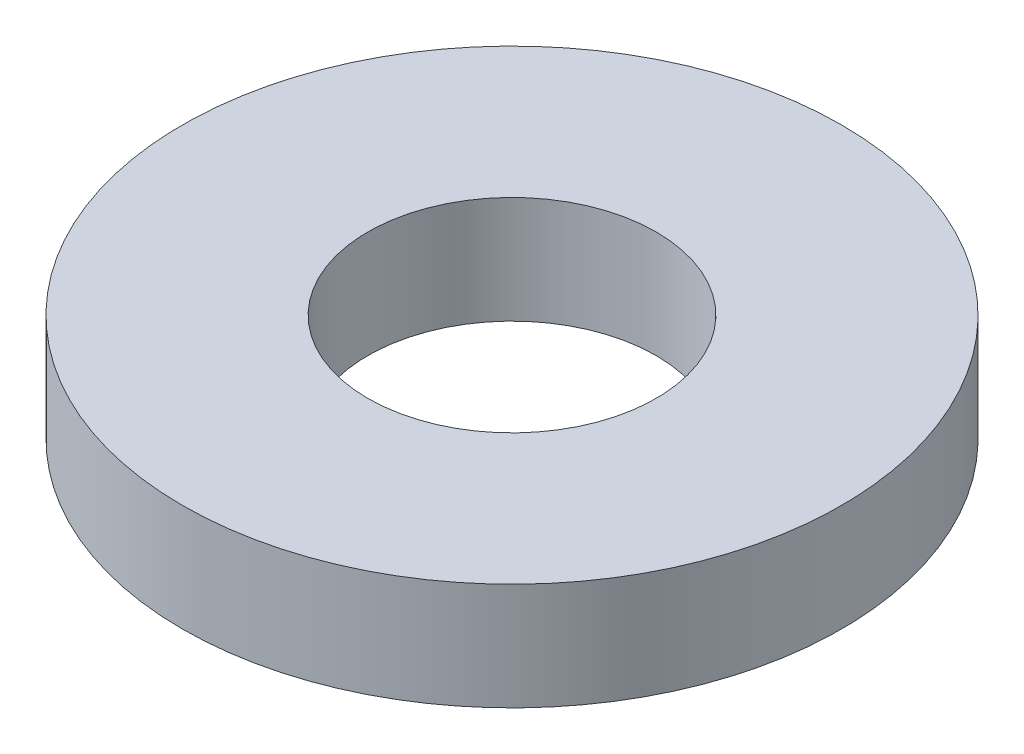
ISO-10303-21;
HEADER;
FILE_DESCRIPTION(('STEP AP214'),'2;1');
FILE_NAME('part.step','',(''),(''),'','','');
FILE_SCHEMA(('AUTOMOTIVE_DESIGN { 1 0 10303 214 1 1 1 1 }'));
ENDSEC;
DATA;
#1=APPLICATION_CONTEXT('core data for automotive mechanical design processes');
#2=APPLICATION_PROTOCOL_DEFINITION('international standard','automotive_design',2000,#1);
#3=PRODUCT_CONTEXT('',#1,'mechanical');
#4=PRODUCT('Part','Part','',(#3));
#5=PRODUCT_RELATED_PRODUCT_CATEGORY('part','',(#4));
#6=PRODUCT_DEFINITION_FORMATION('','',#4);
#7=PRODUCT_DEFINITION_CONTEXT('part definition',#1,'design');
#8=PRODUCT_DEFINITION('design','',#6,#7);
#9=PRODUCT_DEFINITION_SHAPE('','',#8);
#10=(LENGTH_UNIT() NAMED_UNIT(*) SI_UNIT(.MILLI.,.METRE.));
#11=(NAMED_UNIT(*) PLANE_ANGLE_UNIT() SI_UNIT($,.RADIAN.));
#12=(NAMED_UNIT(*) SI_UNIT($,.STERADIAN.) SOLID_ANGLE_UNIT());
#13=UNCERTAINTY_MEASURE_WITH_UNIT(LENGTH_MEASURE(1.E-05),#10,'distance_accuracy_value','');
#14=(GEOMETRIC_REPRESENTATION_CONTEXT(3) GLOBAL_UNCERTAINTY_ASSIGNED_CONTEXT((#13)) GLOBAL_UNIT_ASSIGNED_CONTEXT((#10,
#11,#12)) REPRESENTATION_CONTEXT('',''));
#15=CARTESIAN_POINT('',(0.,0.,0.));
#16=DIRECTION('',(0.,0.,1.));
#17=DIRECTION('',(1.,0.,0.));
#18=AXIS2_PLACEMENT_3D('',#15,#16,#17);
#19=CARTESIAN_POINT('',(0.,13.,0.));
#20=DIRECTION('',(0.,-1.,0.));
#21=DIRECTION('',(0.,0.,-1.));
#22=AXIS2_PLACEMENT_3D('',#19,#20,#21);
#23=CYLINDRICAL_SURFACE('',#22,40.);
#24=CARTESIAN_POINT('',(0.,13.,0.));
#25=DIRECTION('',(0.,1.,0.));
#26=DIRECTION('',(0.,0.,1.));
#27=AXIS2_PLACEMENT_3D('',#24,#25,#26);
#28=CIRCLE('',#27,40.);
#29=CARTESIAN_POINT('',(0.,13.,-40.));
#30=VERTEX_POINT('',#29);
#31=EDGE_CURVE('E10',#30,#30,#28,.T.);
#32=CARTESIAN_POINT('',(0.,0.,0.));
#33=DIRECTION('',(0.,1.,0.));
#34=DIRECTION('',(0.,0.,1.));
#35=AXIS2_PLACEMENT_3D('',#32,#33,#34);
#36=CIRCLE('',#35,40.);
#37=CARTESIAN_POINT('',(0.,0.,-40.));
#38=VERTEX_POINT('',#37);
#39=EDGE_CURVE('E37',#38,#38,#36,.T.);
#40=CARTESIAN_POINT('',(0.,13.,-40.));
#41=CARTESIAN_POINT('',(0.,12.8645833333333,-40.));
#42=CARTESIAN_POINT('',(0.,12.7291666666667,-40.));
#43=CARTESIAN_POINT('',(0.,12.4583333333333,-40.));
#44=CARTESIAN_POINT('',(0.,12.3229166666667,-40.));
#45=CARTESIAN_POINT('',(0.,12.0520833333333,-40.));
#46=CARTESIAN_POINT('',(0.,11.9166666666667,-40.));
#47=CARTESIAN_POINT('',(0.,11.6458333333333,-40.));
#48=CARTESIAN_POINT('',(0.,11.5104166666667,-40.));
#49=CARTESIAN_POINT('',(0.,11.2395833333333,-40.));
#50=CARTESIAN_POINT('',(0.,11.1041666666667,-40.));
#51=CARTESIAN_POINT('',(0.,10.8333333333333,-40.));
#52=CARTESIAN_POINT('',(0.,10.6979166666667,-40.));
#53=CARTESIAN_POINT('',(0.,10.4270833333333,-40.));
#54=CARTESIAN_POINT('',(0.,10.2916666666667,-40.));
#55=CARTESIAN_POINT('',(0.,10.0208333333333,-40.));
#56=CARTESIAN_POINT('',(0.,9.88541666666667,-40.));
#57=CARTESIAN_POINT('',(0.,9.61458333333333,-40.));
#58=CARTESIAN_POINT('',(0.,9.47916666666667,-40.));
#59=CARTESIAN_POINT('',(0.,9.20833333333333,-40.));
#60=CARTESIAN_POINT('',(0.,9.07291666666667,-40.));
#61=CARTESIAN_POINT('',(0.,8.80208333333333,-40.));
#62=CARTESIAN_POINT('',(0.,8.66666666666667,-40.));
#63=CARTESIAN_POINT('',(0.,8.39583333333333,-40.));
#64=CARTESIAN_POINT('',(0.,8.26041666666667,-40.));
#65=CARTESIAN_POINT('',(0.,7.98958333333333,-40.));
#66=CARTESIAN_POINT('',(0.,7.85416666666667,-40.));
#67=CARTESIAN_POINT('',(0.,7.58333333333333,-40.));
#68=CARTESIAN_POINT('',(0.,7.44791666666667,-40.));
#69=CARTESIAN_POINT('',(0.,7.17708333333333,-40.));
#70=CARTESIAN_POINT('',(0.,7.04166666666667,-40.));
#71=CARTESIAN_POINT('',(0.,6.77083333333333,-40.));
#72=CARTESIAN_POINT('',(0.,6.63541666666667,-40.));
#73=CARTESIAN_POINT('',(0.,6.36458333333333,-40.));
#74=CARTESIAN_POINT('',(0.,6.22916666666667,-40.));
#75=CARTESIAN_POINT('',(0.,5.95833333333333,-40.));
#76=CARTESIAN_POINT('',(0.,5.82291666666667,-40.));
#77=CARTESIAN_POINT('',(0.,5.55208333333333,-40.));
#78=CARTESIAN_POINT('',(0.,5.41666666666667,-40.));
#79=CARTESIAN_POINT('',(0.,5.14583333333333,-40.));
#80=CARTESIAN_POINT('',(0.,5.01041666666667,-40.));
#81=CARTESIAN_POINT('',(0.,4.73958333333333,-40.));
#82=CARTESIAN_POINT('',(0.,4.60416666666667,-40.));
#83=CARTESIAN_POINT('',(0.,4.33333333333333,-40.));
#84=CARTESIAN_POINT('',(0.,4.19791666666667,-40.));
#85=CARTESIAN_POINT('',(0.,3.92708333333333,-40.));
#86=CARTESIAN_POINT('',(0.,3.79166666666667,-40.));
#87=CARTESIAN_POINT('',(0.,3.52083333333333,-40.));
#88=CARTESIAN_POINT('',(0.,3.38541666666667,-40.));
#89=CARTESIAN_POINT('',(0.,3.11458333333333,-40.));
#90=CARTESIAN_POINT('',(0.,2.97916666666667,-40.));
#91=CARTESIAN_POINT('',(0.,2.70833333333333,-40.));
#92=CARTESIAN_POINT('',(0.,2.57291666666667,-40.));
#93=CARTESIAN_POINT('',(0.,2.30208333333333,-40.));
#94=CARTESIAN_POINT('',(0.,2.16666666666667,-40.));
#95=CARTESIAN_POINT('',(0.,1.89583333333333,-40.));
#96=CARTESIAN_POINT('',(0.,1.76041666666667,-40.));
#97=CARTESIAN_POINT('',(0.,1.48958333333333,-40.));
#98=CARTESIAN_POINT('',(0.,1.35416666666667,-40.));
#99=CARTESIAN_POINT('',(0.,1.08333333333333,-40.));
#100=CARTESIAN_POINT('',(0.,0.947916666666667,-40.));
#101=CARTESIAN_POINT('',(0.,0.677083333333334,-40.));
#102=CARTESIAN_POINT('',(0.,0.541666666666667,-40.));
#103=CARTESIAN_POINT('',(0.,0.270833333333334,-40.));
#104=CARTESIAN_POINT('',(0.,0.135416666666667,-40.));
#105=CARTESIAN_POINT('',(0.,0.,-40.));
#106=B_SPLINE_CURVE_WITH_KNOTS('',3,(#40,#41,#42,#43,#44,#45,#46,#47,#48,#49,#50,#51,#52,#53,
#54,#55,#56,#57,#58,#59,#60,#61,#62,#63,#64,#65,#66,#67,#68,#69,#70,#71,#72,#73,#74,#75,#76,#77,
#78,#79,#80,#81,#82,#83,#84,#85,#86,#87,#88,#89,#90,#91,#92,#93,#94,#95,#96,#97,#98,#99,#100,
#101,#102,#103,#104,#105),.UNSPECIFIED.,.F.,.F.,(4,2,2,2,2,2,2,2,2,2,2,2,2,2,2,2,2,2,2,2,2,2,2,
2,2,2,2,2,2,2,2,2,4),(0.,0.406249999999999,0.812499999999999,1.21875,1.625,2.03125,2.4375,
2.84375,3.25,3.65625,4.0625,4.46875,4.875,5.28125,5.6875,6.09375,6.5,6.90625,7.3125,7.71875,
8.125,8.53125,8.9375,9.34375,9.75,10.15625,10.5625,10.96875,11.375,11.78125,12.1875,12.59375,
13.),.UNSPECIFIED.);
#107=EDGE_CURVE('BSEAM40',#30,#38,#106,.T.);
#108=ORIENTED_EDGE('',*,*,#31,.F.);
#109=ORIENTED_EDGE('',*,*,#39,.T.);
#110=ORIENTED_EDGE('',*,*,#107,.T.);
#111=ORIENTED_EDGE('',*,*,#107,.F.);
#112=EDGE_LOOP('',(#108,#110,#109,#111));
#113=FACE_BOUND('',#112,.T.);
#114=ADVANCED_FACE('F40',(#113),#23,.T.);
#115=CARTESIAN_POINT('',(0.,13.,0.));
#116=DIRECTION('',(0.,1.,0.));
#117=DIRECTION('',(0.,0.,1.));
#118=AXIS2_PLACEMENT_3D('',#115,#116,#117);
#119=PLANE('',#118);
#120=CARTESIAN_POINT('',(0.,13.,0.));
#121=DIRECTION('',(0.,1.,0.));
#122=DIRECTION('',(0.,0.,1.));
#123=AXIS2_PLACEMENT_3D('',#120,#121,#122);
#124=CIRCLE('',#123,17.5);
#125=CARTESIAN_POINT('',(0.,13.,-17.5));
#126=VERTEX_POINT('',#125);
#127=EDGE_CURVE('E50',#126,#126,#124,.T.);
#128=ORIENTED_EDGE('',*,*,#127,.F.);
#129=EDGE_LOOP('',(#128));
#130=FACE_BOUND('',#129,.T.);
#131=ORIENTED_EDGE('',*,*,#31,.T.);
#132=EDGE_LOOP('',(#131));
#133=FACE_BOUND('',#132,.T.);
#134=ADVANCED_FACE('F59',(#130,#133),#119,.T.);
#135=CARTESIAN_POINT('',(0.,0.,0.));
#136=DIRECTION('',(0.,1.,0.));
#137=DIRECTION('',(0.,0.,1.));
#138=AXIS2_PLACEMENT_3D('',#135,#136,#137);
#139=PLANE('',#138);
#140=CARTESIAN_POINT('',(0.,0.,0.));
#141=DIRECTION('',(0.,1.,0.));
#142=DIRECTION('',(0.,0.,1.));
#143=AXIS2_PLACEMENT_3D('',#140,#141,#142);
#144=CIRCLE('',#143,17.5);
#145=CARTESIAN_POINT('',(0.,0.,-17.5));
#146=VERTEX_POINT('',#145);
#147=EDGE_CURVE('E47',#146,#146,#144,.T.);
#148=ORIENTED_EDGE('',*,*,#147,.T.);
#149=EDGE_LOOP('',(#148));
#150=FACE_BOUND('',#149,.T.);
#151=ORIENTED_EDGE('',*,*,#39,.F.);
#152=EDGE_LOOP('',(#151));
#153=FACE_BOUND('',#152,.T.);
#154=ADVANCED_FACE('F58',(#150,#153),#139,.F.);
#155=CARTESIAN_POINT('',(0.,13.,0.));
#156=DIRECTION('',(0.,-1.,0.));
#157=DIRECTION('',(0.,0.,-1.));
#158=AXIS2_PLACEMENT_3D('',#155,#156,#157);
#159=CYLINDRICAL_SURFACE('',#158,17.5);
#160=CARTESIAN_POINT('',(0.,13.,-17.5));
#161=CARTESIAN_POINT('',(0.,12.8645833333333,-17.5));
#162=CARTESIAN_POINT('',(0.,12.7291666666667,-17.5));
#163=CARTESIAN_POINT('',(0.,12.4583333333333,-17.5));
#164=CARTESIAN_POINT('',(0.,12.3229166666667,-17.5));
#165=CARTESIAN_POINT('',(0.,12.0520833333333,-17.5));
#166=CARTESIAN_POINT('',(0.,11.9166666666667,-17.5));
#167=CARTESIAN_POINT('',(0.,11.6458333333333,-17.5));
#168=CARTESIAN_POINT('',(0.,11.5104166666667,-17.5));
#169=CARTESIAN_POINT('',(0.,11.2395833333333,-17.5));
#170=CARTESIAN_POINT('',(0.,11.1041666666667,-17.5));
#171=CARTESIAN_POINT('',(0.,10.8333333333333,-17.5));
#172=CARTESIAN_POINT('',(0.,10.6979166666667,-17.5));
#173=CARTESIAN_POINT('',(0.,10.4270833333333,-17.5));
#174=CARTESIAN_POINT('',(0.,10.2916666666667,-17.5));
#175=CARTESIAN_POINT('',(0.,10.0208333333333,-17.5));
#176=CARTESIAN_POINT('',(0.,9.88541666666667,-17.5));
#177=CARTESIAN_POINT('',(0.,9.61458333333333,-17.5));
#178=CARTESIAN_POINT('',(0.,9.47916666666667,-17.5));
#179=CARTESIAN_POINT('',(0.,9.20833333333333,-17.5));
#180=CARTESIAN_POINT('',(0.,9.07291666666667,-17.5));
#181=CARTESIAN_POINT('',(0.,8.80208333333333,-17.5));
#182=CARTESIAN_POINT('',(0.,8.66666666666667,-17.5));
#183=CARTESIAN_POINT('',(0.,8.39583333333333,-17.5));
#184=CARTESIAN_POINT('',(0.,8.26041666666667,-17.5));
#185=CARTESIAN_POINT('',(0.,7.98958333333333,-17.5));
#186=CARTESIAN_POINT('',(0.,7.85416666666667,-17.5));
#187=CARTESIAN_POINT('',(0.,7.58333333333333,-17.5));
#188=CARTESIAN_POINT('',(0.,7.44791666666667,-17.5));
#189=CARTESIAN_POINT('',(0.,7.17708333333333,-17.5));
#190=CARTESIAN_POINT('',(0.,7.04166666666667,-17.5));
#191=CARTESIAN_POINT('',(0.,6.77083333333333,-17.5));
#192=CARTESIAN_POINT('',(0.,6.63541666666667,-17.5));
#193=CARTESIAN_POINT('',(0.,6.36458333333333,-17.5));
#194=CARTESIAN_POINT('',(0.,6.22916666666667,-17.5));
#195=CARTESIAN_POINT('',(0.,5.95833333333333,-17.5));
#196=CARTESIAN_POINT('',(0.,5.82291666666667,-17.5));
#197=CARTESIAN_POINT('',(0.,5.55208333333333,-17.5));
#198=CARTESIAN_POINT('',(0.,5.41666666666667,-17.5));
#199=CARTESIAN_POINT('',(0.,5.14583333333333,-17.5));
#200=CARTESIAN_POINT('',(0.,5.01041666666667,-17.5));
#201=CARTESIAN_POINT('',(0.,4.73958333333333,-17.5));
#202=CARTESIAN_POINT('',(0.,4.60416666666667,-17.5));
#203=CARTESIAN_POINT('',(0.,4.33333333333333,-17.5));
#204=CARTESIAN_POINT('',(0.,4.19791666666667,-17.5));
#205=CARTESIAN_POINT('',(0.,3.92708333333333,-17.5));
#206=CARTESIAN_POINT('',(0.,3.79166666666667,-17.5));
#207=CARTESIAN_POINT('',(0.,3.52083333333333,-17.5));
#208=CARTESIAN_POINT('',(0.,3.38541666666667,-17.5));
#209=CARTESIAN_POINT('',(0.,3.11458333333333,-17.5));
#210=CARTESIAN_POINT('',(0.,2.97916666666667,-17.5));
#211=CARTESIAN_POINT('',(0.,2.70833333333333,-17.5));
#212=CARTESIAN_POINT('',(0.,2.57291666666667,-17.5));
#213=CARTESIAN_POINT('',(0.,2.30208333333333,-17.5));
#214=CARTESIAN_POINT('',(0.,2.16666666666667,-17.5));
#215=CARTESIAN_POINT('',(0.,1.89583333333333,-17.5));
#216=CARTESIAN_POINT('',(0.,1.76041666666667,-17.5));
#217=CARTESIAN_POINT('',(0.,1.48958333333333,-17.5));
#218=CARTESIAN_POINT('',(0.,1.35416666666667,-17.5));
#219=CARTESIAN_POINT('',(0.,1.08333333333333,-17.5));
#220=CARTESIAN_POINT('',(0.,0.947916666666667,-17.5));
#221=CARTESIAN_POINT('',(0.,0.677083333333334,-17.5));
#222=CARTESIAN_POINT('',(0.,0.541666666666667,-17.5));
#223=CARTESIAN_POINT('',(0.,0.270833333333334,-17.5));
#224=CARTESIAN_POINT('',(0.,0.135416666666667,-17.5));
#225=CARTESIAN_POINT('',(0.,0.,-17.5));
#226=B_SPLINE_CURVE_WITH_KNOTS('',3,(#160,#161,#162,#163,#164,#165,#166,#167,#168,#169,#170,
#171,#172,#173,#174,#175,#176,#177,#178,#179,#180,#181,#182,#183,#184,#185,#186,#187,#188,#189,
#190,#191,#192,#193,#194,#195,#196,#197,#198,#199,#200,#201,#202,#203,#204,#205,#206,#207,#208,
#209,#210,#211,#212,#213,#214,#215,#216,#217,#218,#219,#220,#221,#222,#223,#224,#225),
.UNSPECIFIED.,.F.,.F.,(4,2,2,2,2,2,2,2,2,2,2,2,2,2,2,2,2,2,2,2,2,2,2,2,2,2,2,2,2,2,2,2,4),(0.,
0.406249999999999,0.812499999999999,1.21875,1.625,2.03125,2.4375,2.84375,3.25,3.65625,4.0625,
4.46875,4.875,5.28125,5.6875,6.09375,6.5,6.90625,7.3125,7.71875,8.125,8.53125,8.9375,9.34375,
9.75,10.15625,10.5625,10.96875,11.375,11.78125,12.1875,12.59375,13.),.UNSPECIFIED.);
#227=EDGE_CURVE('BSEAM54',#126,#146,#226,.T.);
#228=ORIENTED_EDGE('',*,*,#127,.T.);
#229=ORIENTED_EDGE('',*,*,#147,.F.);
#230=ORIENTED_EDGE('',*,*,#227,.T.);
#231=ORIENTED_EDGE('',*,*,#227,.F.);
#232=EDGE_LOOP('',(#228,#230,#229,#231));
#233=FACE_BOUND('',#232,.T.);
#234=ADVANCED_FACE('F54',(#233),#159,.F.);
#235=CLOSED_SHELL('',(#114,#134,#154,#234));
#236=MANIFOLD_SOLID_BREP('B2',#235);
#237=ADVANCED_BREP_SHAPE_REPRESENTATION('',(#18,#236),#14);
#238=SHAPE_DEFINITION_REPRESENTATION(#9,#237);
ENDSEC;
END-ISO-10303-21;
